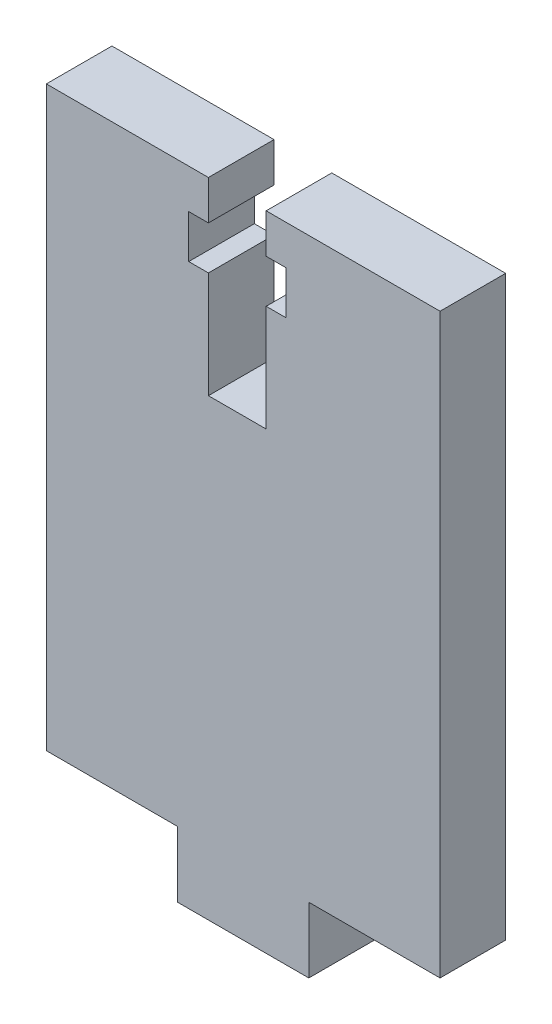
ISO-10303-21;
HEADER;
FILE_DESCRIPTION(('STEP AP214'),'2;1');
FILE_NAME('part.step','',(''),(''),'','','');
FILE_SCHEMA(('AUTOMOTIVE_DESIGN { 1 0 10303 214 1 1 1 1 }'));
ENDSEC;
DATA;
#1=APPLICATION_CONTEXT('core data for automotive mechanical design processes');
#2=APPLICATION_PROTOCOL_DEFINITION('international standard','automotive_design',2000,#1);
#3=PRODUCT_CONTEXT('',#1,'mechanical');
#4=PRODUCT('Part','Part','',(#3));
#5=PRODUCT_RELATED_PRODUCT_CATEGORY('part','',(#4));
#6=PRODUCT_DEFINITION_FORMATION('','',#4);
#7=PRODUCT_DEFINITION_CONTEXT('part definition',#1,'design');
#8=PRODUCT_DEFINITION('design','',#6,#7);
#9=PRODUCT_DEFINITION_SHAPE('','',#8);
#10=(LENGTH_UNIT() NAMED_UNIT(*) SI_UNIT(.MILLI.,.METRE.));
#11=(NAMED_UNIT(*) PLANE_ANGLE_UNIT() SI_UNIT($,.RADIAN.));
#12=(NAMED_UNIT(*) SI_UNIT($,.STERADIAN.) SOLID_ANGLE_UNIT());
#13=UNCERTAINTY_MEASURE_WITH_UNIT(LENGTH_MEASURE(1.E-05),#10,'distance_accuracy_value','');
#14=(GEOMETRIC_REPRESENTATION_CONTEXT(3) GLOBAL_UNCERTAINTY_ASSIGNED_CONTEXT((#13)) GLOBAL_UNIT_ASSIGNED_CONTEXT((#10,
#11,#12)) REPRESENTATION_CONTEXT('',''));
#15=CARTESIAN_POINT('',(0.,0.,0.));
#16=DIRECTION('',(0.,0.,1.));
#17=DIRECTION('',(1.,0.,0.));
#18=AXIS2_PLACEMENT_3D('',#15,#16,#17);
#19=CARTESIAN_POINT('',(14.7232304900181,49.,5.));
#20=DIRECTION('',(0.,-1.,0.));
#21=DIRECTION('',(0.,0.,-1.));
#22=AXIS2_PLACEMENT_3D('',#19,#20,#21);
#23=PLANE('',#22);
#24=DIRECTION('',(-1.,0.,0.));
#25=VECTOR('',#24,1.);
#26=CARTESIAN_POINT('',(14.7232304900181,49.,0.));
#27=LINE('',#26,#25);
#28=CARTESIAN_POINT('',(14.7232304900181,49.,0.));
#29=VERTEX_POINT('',#28);
#30=CARTESIAN_POINT('',(1.47285559554635,49.,0.));
#31=VERTEX_POINT('',#30);
#32=EDGE_CURVE('E159',#29,#31,#27,.T.);
#33=ORIENTED_EDGE('',*,*,#32,.T.);
#34=DIRECTION('',(0.,0.,-1.));
#35=VECTOR('',#34,1.);
#36=CARTESIAN_POINT('',(1.47285559554635,49.,5.));
#37=LINE('',#36,#35);
#38=CARTESIAN_POINT('',(1.47285559554635,49.,5.));
#39=VERTEX_POINT('',#38);
#40=EDGE_CURVE('E224',#39,#31,#37,.T.);
#41=ORIENTED_EDGE('',*,*,#40,.F.);
#42=DIRECTION('',(-1.,0.,0.));
#43=VECTOR('',#42,1.);
#44=CARTESIAN_POINT('',(14.7232304900181,49.,5.));
#45=LINE('',#44,#43);
#46=CARTESIAN_POINT('',(14.7232304900181,49.,5.));
#47=VERTEX_POINT('',#46);
#48=EDGE_CURVE('E127',#47,#39,#45,.T.);
#49=ORIENTED_EDGE('',*,*,#48,.F.);
#50=DIRECTION('',(0.,0.,-1.));
#51=VECTOR('',#50,1.);
#52=CARTESIAN_POINT('',(14.7232304900181,49.,5.));
#53=LINE('',#52,#51);
#54=EDGE_CURVE('E137',#47,#29,#53,.T.);
#55=ORIENTED_EDGE('',*,*,#54,.T.);
#56=EDGE_LOOP('',(#33,#41,#49,#55));
#57=FACE_BOUND('',#56,.T.);
#58=ADVANCED_FACE('F32',(#57),#23,.F.);
#59=CARTESIAN_POINT('',(-5.27676950998187,5.,5.));
#60=DIRECTION('',(1.,0.,0.));
#61=DIRECTION('',(0.,0.,-1.));
#62=AXIS2_PLACEMENT_3D('',#59,#60,#61);
#63=PLANE('',#62);
#64=DIRECTION('',(0.,-1.,0.));
#65=VECTOR('',#64,1.);
#66=CARTESIAN_POINT('',(-5.27676950998187,5.,0.));
#67=LINE('',#66,#65);
#68=CARTESIAN_POINT('',(-5.27676950998187,5.,0.));
#69=VERTEX_POINT('',#68);
#70=CARTESIAN_POINT('',(-5.27676950998187,0.,0.));
#71=VERTEX_POINT('',#70);
#72=EDGE_CURVE('E147',#69,#71,#67,.T.);
#73=ORIENTED_EDGE('',*,*,#72,.T.);
#74=DIRECTION('',(0.,0.,-1.));
#75=VECTOR('',#74,1.);
#76=CARTESIAN_POINT('',(-5.27676950998187,0.,5.));
#77=LINE('',#76,#75);
#78=CARTESIAN_POINT('',(-5.27676950998187,0.,5.));
#79=VERTEX_POINT('',#78);
#80=EDGE_CURVE('E11',#79,#71,#77,.T.);
#81=ORIENTED_EDGE('',*,*,#80,.F.);
#82=DIRECTION('',(0.,-1.,0.));
#83=VECTOR('',#82,1.);
#84=CARTESIAN_POINT('',(-5.27676950998187,5.,5.));
#85=LINE('',#84,#83);
#86=CARTESIAN_POINT('',(-5.27676950998187,5.,5.));
#87=VERTEX_POINT('',#86);
#88=EDGE_CURVE('E165',#87,#79,#85,.T.);
#89=ORIENTED_EDGE('',*,*,#88,.F.);
#90=DIRECTION('',(0.,0.,-1.));
#91=VECTOR('',#90,1.);
#92=CARTESIAN_POINT('',(-5.27676950998187,5.,5.));
#93=LINE('',#92,#91);
#94=EDGE_CURVE('E142',#87,#69,#93,.T.);
#95=ORIENTED_EDGE('',*,*,#94,.T.);
#96=EDGE_LOOP('',(#73,#81,#89,#95));
#97=FACE_BOUND('',#96,.T.);
#98=ADVANCED_FACE('F34',(#97),#63,.F.);
#99=CARTESIAN_POINT('',(-5.27676950998187,0.,5.));
#100=DIRECTION('',(0.,1.,0.));
#101=DIRECTION('',(0.,0.,1.));
#102=AXIS2_PLACEMENT_3D('',#99,#100,#101);
#103=PLANE('',#102);
#104=DIRECTION('',(1.,0.,0.));
#105=VECTOR('',#104,1.);
#106=CARTESIAN_POINT('',(-5.27676950998187,0.,0.));
#107=LINE('',#106,#105);
#108=CARTESIAN_POINT('',(4.72323049001813,0.,0.));
#109=VERTEX_POINT('',#108);
#110=EDGE_CURVE('E150',#71,#109,#107,.T.);
#111=ORIENTED_EDGE('',*,*,#110,.T.);
#112=DIRECTION('',(0.,0.,-1.));
#113=VECTOR('',#112,1.);
#114=CARTESIAN_POINT('',(4.72323049001813,0.,5.));
#115=LINE('',#114,#113);
#116=CARTESIAN_POINT('',(4.72323049001813,0.,5.));
#117=VERTEX_POINT('',#116);
#118=EDGE_CURVE('E40',#117,#109,#115,.T.);
#119=ORIENTED_EDGE('',*,*,#118,.F.);
#120=DIRECTION('',(1.,0.,0.));
#121=VECTOR('',#120,1.);
#122=CARTESIAN_POINT('',(-5.27676950998187,0.,5.));
#123=LINE('',#122,#121);
#124=EDGE_CURVE('E97',#79,#117,#123,.T.);
#125=ORIENTED_EDGE('',*,*,#124,.F.);
#126=ORIENTED_EDGE('',*,*,#80,.T.);
#127=EDGE_LOOP('',(#111,#119,#125,#126));
#128=FACE_BOUND('',#127,.T.);
#129=ADVANCED_FACE('F380',(#128),#103,.F.);
#130=CARTESIAN_POINT('',(4.72323049001813,0.,5.));
#131=DIRECTION('',(-1.,0.,0.));
#132=DIRECTION('',(0.,0.,1.));
#133=AXIS2_PLACEMENT_3D('',#130,#131,#132);
#134=PLANE('',#133);
#135=DIRECTION('',(0.,1.,0.));
#136=VECTOR('',#135,1.);
#137=CARTESIAN_POINT('',(4.72323049001813,0.,0.));
#138=LINE('',#137,#136);
#139=CARTESIAN_POINT('',(4.72323049001813,5.,0.));
#140=VERTEX_POINT('',#139);
#141=EDGE_CURVE('E153',#109,#140,#138,.T.);
#142=ORIENTED_EDGE('',*,*,#141,.T.);
#143=DIRECTION('',(0.,0.,-1.));
#144=VECTOR('',#143,1.);
#145=CARTESIAN_POINT('',(4.72323049001813,5.,5.));
#146=LINE('',#145,#144);
#147=CARTESIAN_POINT('',(4.72323049001813,5.,5.));
#148=VERTEX_POINT('',#147);
#149=EDGE_CURVE('E173',#148,#140,#146,.T.);
#150=ORIENTED_EDGE('',*,*,#149,.F.);
#151=DIRECTION('',(0.,1.,0.));
#152=VECTOR('',#151,1.);
#153=CARTESIAN_POINT('',(4.72323049001813,0.,5.));
#154=LINE('',#153,#152);
#155=EDGE_CURVE('E181',#117,#148,#154,.T.);
#156=ORIENTED_EDGE('',*,*,#155,.F.);
#157=ORIENTED_EDGE('',*,*,#118,.T.);
#158=EDGE_LOOP('',(#142,#150,#156,#157));
#159=FACE_BOUND('',#158,.T.);
#160=ADVANCED_FACE('F179',(#159),#134,.F.);
#161=CARTESIAN_POINT('',(4.72323049001813,5.,5.));
#162=DIRECTION('',(0.,1.,0.));
#163=DIRECTION('',(0.,0.,1.));
#164=AXIS2_PLACEMENT_3D('',#161,#162,#163);
#165=PLANE('',#164);
#166=DIRECTION('',(1.,0.,0.));
#167=VECTOR('',#166,1.);
#168=CARTESIAN_POINT('',(4.72323049001813,5.,0.));
#169=LINE('',#168,#167);
#170=CARTESIAN_POINT('',(14.7232304900181,5.,0.));
#171=VERTEX_POINT('',#170);
#172=EDGE_CURVE('E155',#140,#171,#169,.T.);
#173=ORIENTED_EDGE('',*,*,#172,.T.);
#174=DIRECTION('',(0.,0.,-1.));
#175=VECTOR('',#174,1.);
#176=CARTESIAN_POINT('',(14.7232304900181,5.,5.));
#177=LINE('',#176,#175);
#178=CARTESIAN_POINT('',(14.7232304900181,5.,5.));
#179=VERTEX_POINT('',#178);
#180=EDGE_CURVE('E170',#179,#171,#177,.T.);
#181=ORIENTED_EDGE('',*,*,#180,.F.);
#182=DIRECTION('',(1.,0.,0.));
#183=VECTOR('',#182,1.);
#184=CARTESIAN_POINT('',(4.72323049001813,5.,5.));
#185=LINE('',#184,#183);
#186=EDGE_CURVE('E198',#148,#179,#185,.T.);
#187=ORIENTED_EDGE('',*,*,#186,.F.);
#188=ORIENTED_EDGE('',*,*,#149,.T.);
#189=EDGE_LOOP('',(#173,#181,#187,#188));
#190=FACE_BOUND('',#189,.T.);
#191=ADVANCED_FACE('F191',(#190),#165,.F.);
#192=CARTESIAN_POINT('',(14.7232304900181,5.,5.));
#193=DIRECTION('',(-1.,0.,0.));
#194=DIRECTION('',(0.,0.,1.));
#195=AXIS2_PLACEMENT_3D('',#192,#193,#194);
#196=PLANE('',#195);
#197=DIRECTION('',(0.,1.,0.));
#198=VECTOR('',#197,1.);
#199=CARTESIAN_POINT('',(14.7232304900181,5.,0.));
#200=LINE('',#199,#198);
#201=EDGE_CURVE('E157',#171,#29,#200,.T.);
#202=ORIENTED_EDGE('',*,*,#201,.T.);
#203=ORIENTED_EDGE('',*,*,#54,.F.);
#204=DIRECTION('',(0.,1.,0.));
#205=VECTOR('',#204,1.);
#206=CARTESIAN_POINT('',(14.7232304900181,5.,5.));
#207=LINE('',#206,#205);
#208=EDGE_CURVE('E128',#179,#47,#207,.T.);
#209=ORIENTED_EDGE('',*,*,#208,.F.);
#210=ORIENTED_EDGE('',*,*,#180,.T.);
#211=EDGE_LOOP('',(#202,#203,#209,#210));
#212=FACE_BOUND('',#211,.T.);
#213=ADVANCED_FACE('F195',(#212),#196,.F.);
#214=CARTESIAN_POINT('',(-2.92714440445365,49.,5.));
#215=VERTEX_POINT('',#214);
#216=CARTESIAN_POINT('',(-15.2767695099819,49.,5.));
#217=VERTEX_POINT('',#216);
#218=EDGE_CURVE('E114',#215,#217,#45,.T.);
#219=ORIENTED_EDGE('',*,*,#218,.F.);
#220=DIRECTION('',(0.,0.,-1.));
#221=VECTOR('',#220,1.);
#222=CARTESIAN_POINT('',(-2.92714440445365,49.,5.));
#223=LINE('',#222,#221);
#224=CARTESIAN_POINT('',(-2.92714440445365,49.,0.));
#225=VERTEX_POINT('',#224);
#226=EDGE_CURVE('E222',#215,#225,#223,.T.);
#227=ORIENTED_EDGE('',*,*,#226,.T.);
#228=CARTESIAN_POINT('',(-15.2767695099819,49.,0.));
#229=VERTEX_POINT('',#228);
#230=EDGE_CURVE('E134',#225,#229,#27,.T.);
#231=ORIENTED_EDGE('',*,*,#230,.T.);
#232=DIRECTION('',(0.,0.,-1.));
#233=VECTOR('',#232,1.);
#234=CARTESIAN_POINT('',(-15.2767695099819,49.,5.));
#235=LINE('',#234,#233);
#236=EDGE_CURVE('E131',#217,#229,#235,.T.);
#237=ORIENTED_EDGE('',*,*,#236,.F.);
#238=EDGE_LOOP('',(#219,#227,#231,#237));
#239=FACE_BOUND('',#238,.T.);
#240=ADVANCED_FACE('F132',(#239),#23,.F.);
#241=CARTESIAN_POINT('',(-15.2767695099819,49.,5.));
#242=DIRECTION('',(1.,0.,0.));
#243=DIRECTION('',(0.,1.,0.));
#244=AXIS2_PLACEMENT_3D('',#241,#242,#243);
#245=PLANE('',#244);
#246=DIRECTION('',(0.,-1.,0.));
#247=VECTOR('',#246,1.);
#248=CARTESIAN_POINT('',(-15.2767695099819,49.,0.));
#249=LINE('',#248,#247);
#250=CARTESIAN_POINT('',(-15.2767695099819,5.,0.));
#251=VERTEX_POINT('',#250);
#252=EDGE_CURVE('E162',#229,#251,#249,.T.);
#253=ORIENTED_EDGE('',*,*,#252,.T.);
#254=DIRECTION('',(0.,0.,-1.));
#255=VECTOR('',#254,1.);
#256=CARTESIAN_POINT('',(-15.2767695099819,5.,5.));
#257=LINE('',#256,#255);
#258=CARTESIAN_POINT('',(-15.2767695099819,5.,5.));
#259=VERTEX_POINT('',#258);
#260=EDGE_CURVE('E138',#259,#251,#257,.T.);
#261=ORIENTED_EDGE('',*,*,#260,.F.);
#262=DIRECTION('',(0.,-1.,0.));
#263=VECTOR('',#262,1.);
#264=CARTESIAN_POINT('',(-15.2767695099819,49.,5.));
#265=LINE('',#264,#263);
#266=EDGE_CURVE('E119',#217,#259,#265,.T.);
#267=ORIENTED_EDGE('',*,*,#266,.F.);
#268=ORIENTED_EDGE('',*,*,#236,.T.);
#269=EDGE_LOOP('',(#253,#261,#267,#268));
#270=FACE_BOUND('',#269,.T.);
#271=ADVANCED_FACE('F140',(#270),#245,.F.);
#272=CARTESIAN_POINT('',(-15.2767695099819,5.,5.));
#273=DIRECTION('',(0.,1.,0.));
#274=DIRECTION('',(0.,0.,1.));
#275=AXIS2_PLACEMENT_3D('',#272,#273,#274);
#276=PLANE('',#275);
#277=DIRECTION('',(1.,0.,0.));
#278=VECTOR('',#277,1.);
#279=CARTESIAN_POINT('',(-15.2767695099819,5.,0.));
#280=LINE('',#279,#278);
#281=EDGE_CURVE('E89',#251,#69,#280,.T.);
#282=ORIENTED_EDGE('',*,*,#281,.T.);
#283=ORIENTED_EDGE('',*,*,#94,.F.);
#284=DIRECTION('',(1.,0.,0.));
#285=VECTOR('',#284,1.);
#286=CARTESIAN_POINT('',(-15.2767695099819,5.,5.));
#287=LINE('',#286,#285);
#288=EDGE_CURVE('E56',#259,#87,#287,.T.);
#289=ORIENTED_EDGE('',*,*,#288,.F.);
#290=ORIENTED_EDGE('',*,*,#260,.T.);
#291=EDGE_LOOP('',(#282,#283,#289,#290));
#292=FACE_BOUND('',#291,.T.);
#293=ADVANCED_FACE('F389',(#292),#276,.F.);
#294=CARTESIAN_POINT('',(0.,0.,5.));
#295=DIRECTION('',(0.,0.,1.));
#296=DIRECTION('',(1.,0.,0.));
#297=AXIS2_PLACEMENT_3D('',#294,#295,#296);
#298=PLANE('',#297);
#299=DIRECTION('',(0.,-1.,0.));
#300=VECTOR('',#299,1.);
#301=CARTESIAN_POINT('',(1.47285559554635,46.,5.));
#302=LINE('',#301,#300);
#303=CARTESIAN_POINT('',(1.47285559554635,46.,5.));
#304=VERTEX_POINT('',#303);
#305=EDGE_CURVE('E277',#39,#304,#302,.T.);
#306=ORIENTED_EDGE('',*,*,#305,.T.);
#307=DIRECTION('',(1.,0.,0.));
#308=VECTOR('',#307,1.);
#309=CARTESIAN_POINT('',(2.97285559554635,46.,5.));
#310=LINE('',#309,#308);
#311=CARTESIAN_POINT('',(2.97285559554635,46.,5.));
#312=VERTEX_POINT('',#311);
#313=EDGE_CURVE('E274',#304,#312,#310,.T.);
#314=ORIENTED_EDGE('',*,*,#313,.T.);
#315=DIRECTION('',(0.,-1.,0.));
#316=VECTOR('',#315,1.);
#317=CARTESIAN_POINT('',(2.97285559554637,42.7,5.));
#318=LINE('',#317,#316);
#319=CARTESIAN_POINT('',(2.97285559554637,42.7,5.));
#320=VERTEX_POINT('',#319);
#321=EDGE_CURVE('E271',#312,#320,#318,.T.);
#322=ORIENTED_EDGE('',*,*,#321,.T.);
#323=DIRECTION('',(-1.,0.,0.));
#324=VECTOR('',#323,1.);
#325=CARTESIAN_POINT('',(1.47285559554635,42.7,5.));
#326=LINE('',#325,#324);
#327=CARTESIAN_POINT('',(1.47285559554635,42.7,5.));
#328=VERTEX_POINT('',#327);
#329=EDGE_CURVE('E207',#320,#328,#326,.T.);
#330=ORIENTED_EDGE('',*,*,#329,.T.);
#331=DIRECTION('',(0.,-1.,0.));
#332=VECTOR('',#331,1.);
#333=CARTESIAN_POINT('',(1.47285559554633,34.6,5.));
#334=LINE('',#333,#332);
#335=CARTESIAN_POINT('',(1.47285559554633,34.6,5.));
#336=VERTEX_POINT('',#335);
#337=EDGE_CURVE('E240',#328,#336,#334,.T.);
#338=ORIENTED_EDGE('',*,*,#337,.T.);
#339=DIRECTION('',(-1.,0.,0.));
#340=VECTOR('',#339,1.);
#341=CARTESIAN_POINT('',(1.47285559554633,34.6,5.));
#342=LINE('',#341,#340);
#343=CARTESIAN_POINT('',(-2.92714440445368,34.6,5.));
#344=VERTEX_POINT('',#343);
#345=EDGE_CURVE('E291',#336,#344,#342,.T.);
#346=ORIENTED_EDGE('',*,*,#345,.T.);
#347=DIRECTION('',(0.,1.,0.));
#348=VECTOR('',#347,1.);
#349=CARTESIAN_POINT('',(-2.92714440445365,42.7,5.));
#350=LINE('',#349,#348);
#351=CARTESIAN_POINT('',(-2.92714440445365,42.7,5.));
#352=VERTEX_POINT('',#351);
#353=EDGE_CURVE('E288',#344,#352,#350,.T.);
#354=ORIENTED_EDGE('',*,*,#353,.T.);
#355=DIRECTION('',(-1.,0.,0.));
#356=VECTOR('',#355,1.);
#357=CARTESIAN_POINT('',(-4.42714440445366,42.7,5.));
#358=LINE('',#357,#356);
#359=CARTESIAN_POINT('',(-4.42714440445366,42.7,5.));
#360=VERTEX_POINT('',#359);
#361=EDGE_CURVE('E285',#352,#360,#358,.T.);
#362=ORIENTED_EDGE('',*,*,#361,.T.);
#363=DIRECTION('',(0.,1.,0.));
#364=VECTOR('',#363,1.);
#365=CARTESIAN_POINT('',(-4.42714440445366,46.,5.));
#366=LINE('',#365,#364);
#367=CARTESIAN_POINT('',(-4.42714440445366,46.,5.));
#368=VERTEX_POINT('',#367);
#369=EDGE_CURVE('E282',#360,#368,#366,.T.);
#370=ORIENTED_EDGE('',*,*,#369,.T.);
#371=DIRECTION('',(1.,0.,0.));
#372=VECTOR('',#371,1.);
#373=CARTESIAN_POINT('',(-2.92714440445365,46.,5.));
#374=LINE('',#373,#372);
#375=CARTESIAN_POINT('',(-2.92714440445365,46.,5.));
#376=VERTEX_POINT('',#375);
#377=EDGE_CURVE('E280',#368,#376,#374,.T.);
#378=ORIENTED_EDGE('',*,*,#377,.T.);
#379=DIRECTION('',(0.,1.,0.));
#380=VECTOR('',#379,1.);
#381=CARTESIAN_POINT('',(-2.92714440445365,49.,5.));
#382=LINE('',#381,#380);
#383=EDGE_CURVE('E124',#376,#215,#382,.T.);
#384=ORIENTED_EDGE('',*,*,#383,.T.);
#385=ORIENTED_EDGE('',*,*,#218,.T.);
#386=ORIENTED_EDGE('',*,*,#266,.T.);
#387=ORIENTED_EDGE('',*,*,#288,.T.);
#388=ORIENTED_EDGE('',*,*,#88,.T.);
#389=ORIENTED_EDGE('',*,*,#124,.T.);
#390=ORIENTED_EDGE('',*,*,#155,.T.);
#391=ORIENTED_EDGE('',*,*,#186,.T.);
#392=ORIENTED_EDGE('',*,*,#208,.T.);
#393=ORIENTED_EDGE('',*,*,#48,.T.);
#394=EDGE_LOOP('',(#306,#314,#322,#330,#338,#346,#354,#362,#370,#378,#384,#385,#386,#387,#388,
#389,#390,#391,#392,#393));
#395=FACE_BOUND('',#394,.T.);
#396=ADVANCED_FACE('F117',(#395),#298,.T.);
#397=CARTESIAN_POINT('',(0.,0.,0.));
#398=DIRECTION('',(0.,0.,1.));
#399=DIRECTION('',(1.,0.,0.));
#400=AXIS2_PLACEMENT_3D('',#397,#398,#399);
#401=PLANE('',#400);
#402=DIRECTION('',(1.,0.,0.));
#403=VECTOR('',#402,1.);
#404=CARTESIAN_POINT('',(2.97285559554635,46.,0.));
#405=LINE('',#404,#403);
#406=CARTESIAN_POINT('',(1.47285559554635,46.,0.));
#407=VERTEX_POINT('',#406);
#408=CARTESIAN_POINT('',(2.97285559554635,46.,0.));
#409=VERTEX_POINT('',#408);
#410=EDGE_CURVE('E244',#407,#409,#405,.T.);
#411=ORIENTED_EDGE('',*,*,#410,.F.);
#412=DIRECTION('',(0.,-1.,0.));
#413=VECTOR('',#412,1.);
#414=CARTESIAN_POINT('',(1.47285559554635,46.,0.));
#415=LINE('',#414,#413);
#416=EDGE_CURVE('E247',#31,#407,#415,.T.);
#417=ORIENTED_EDGE('',*,*,#416,.F.);
#418=ORIENTED_EDGE('',*,*,#32,.F.);
#419=ORIENTED_EDGE('',*,*,#201,.F.);
#420=ORIENTED_EDGE('',*,*,#172,.F.);
#421=ORIENTED_EDGE('',*,*,#141,.F.);
#422=ORIENTED_EDGE('',*,*,#110,.F.);
#423=ORIENTED_EDGE('',*,*,#72,.F.);
#424=ORIENTED_EDGE('',*,*,#281,.F.);
#425=ORIENTED_EDGE('',*,*,#252,.F.);
#426=ORIENTED_EDGE('',*,*,#230,.F.);
#427=DIRECTION('',(0.,1.,0.));
#428=VECTOR('',#427,1.);
#429=CARTESIAN_POINT('',(-2.92714440445365,49.,0.));
#430=LINE('',#429,#428);
#431=CARTESIAN_POINT('',(-2.92714440445365,46.,0.));
#432=VERTEX_POINT('',#431);
#433=EDGE_CURVE('E250',#432,#225,#430,.T.);
#434=ORIENTED_EDGE('',*,*,#433,.F.);
#435=DIRECTION('',(1.,0.,0.));
#436=VECTOR('',#435,1.);
#437=CARTESIAN_POINT('',(-2.92714440445365,46.,0.));
#438=LINE('',#437,#436);
#439=CARTESIAN_POINT('',(-4.42714440445366,46.,0.));
#440=VERTEX_POINT('',#439);
#441=EDGE_CURVE('E253',#440,#432,#438,.T.);
#442=ORIENTED_EDGE('',*,*,#441,.F.);
#443=DIRECTION('',(0.,1.,0.));
#444=VECTOR('',#443,1.);
#445=CARTESIAN_POINT('',(-4.42714440445366,46.,0.));
#446=LINE('',#445,#444);
#447=CARTESIAN_POINT('',(-4.42714440445366,42.7,0.));
#448=VERTEX_POINT('',#447);
#449=EDGE_CURVE('E256',#448,#440,#446,.T.);
#450=ORIENTED_EDGE('',*,*,#449,.F.);
#451=DIRECTION('',(-1.,0.,0.));
#452=VECTOR('',#451,1.);
#453=CARTESIAN_POINT('',(-4.42714440445366,42.7,0.));
#454=LINE('',#453,#452);
#455=CARTESIAN_POINT('',(-2.92714440445365,42.7,0.));
#456=VERTEX_POINT('',#455);
#457=EDGE_CURVE('E259',#456,#448,#454,.T.);
#458=ORIENTED_EDGE('',*,*,#457,.F.);
#459=DIRECTION('',(0.,1.,0.));
#460=VECTOR('',#459,1.);
#461=CARTESIAN_POINT('',(-2.92714440445365,42.7,0.));
#462=LINE('',#461,#460);
#463=CARTESIAN_POINT('',(-2.92714440445368,34.6,0.));
#464=VERTEX_POINT('',#463);
#465=EDGE_CURVE('E262',#464,#456,#462,.T.);
#466=ORIENTED_EDGE('',*,*,#465,.F.);
#467=DIRECTION('',(-1.,0.,0.));
#468=VECTOR('',#467,1.);
#469=CARTESIAN_POINT('',(1.47285559554633,34.6,0.));
#470=LINE('',#469,#468);
#471=CARTESIAN_POINT('',(1.47285559554633,34.6,0.));
#472=VERTEX_POINT('',#471);
#473=EDGE_CURVE('E265',#472,#464,#470,.T.);
#474=ORIENTED_EDGE('',*,*,#473,.F.);
#475=DIRECTION('',(0.,-1.,0.));
#476=VECTOR('',#475,1.);
#477=CARTESIAN_POINT('',(1.47285559554633,34.6,0.));
#478=LINE('',#477,#476);
#479=CARTESIAN_POINT('',(1.47285559554635,42.7,0.));
#480=VERTEX_POINT('',#479);
#481=EDGE_CURVE('E47',#480,#472,#478,.T.);
#482=ORIENTED_EDGE('',*,*,#481,.F.);
#483=DIRECTION('',(-1.,0.,0.));
#484=VECTOR('',#483,1.);
#485=CARTESIAN_POINT('',(1.47285559554635,42.7,0.));
#486=LINE('',#485,#484);
#487=CARTESIAN_POINT('',(2.97285559554637,42.7,0.));
#488=VERTEX_POINT('',#487);
#489=EDGE_CURVE('E237',#488,#480,#486,.T.);
#490=ORIENTED_EDGE('',*,*,#489,.F.);
#491=DIRECTION('',(0.,-1.,0.));
#492=VECTOR('',#491,1.);
#493=CARTESIAN_POINT('',(2.97285559554637,42.7,0.));
#494=LINE('',#493,#492);
#495=EDGE_CURVE('E241',#409,#488,#494,.T.);
#496=ORIENTED_EDGE('',*,*,#495,.F.);
#497=EDGE_LOOP('',(#411,#417,#418,#419,#420,#421,#422,#423,#424,#425,#426,#434,#442,#450,#458,
#466,#474,#482,#490,#496));
#498=FACE_BOUND('',#497,.T.);
#499=ADVANCED_FACE('F185',(#498),#401,.F.);
#500=CARTESIAN_POINT('',(1.47285559554633,34.6,5.));
#501=DIRECTION('',(1.,0.,0.));
#502=DIRECTION('',(0.,1.,0.));
#503=AXIS2_PLACEMENT_3D('',#500,#501,#502);
#504=PLANE('',#503);
#505=ORIENTED_EDGE('',*,*,#481,.T.);
#506=DIRECTION('',(0.,0.,-1.));
#507=VECTOR('',#506,1.);
#508=CARTESIAN_POINT('',(1.47285559554633,34.6,5.));
#509=LINE('',#508,#507);
#510=EDGE_CURVE('E204',#336,#472,#509,.T.);
#511=ORIENTED_EDGE('',*,*,#510,.F.);
#512=ORIENTED_EDGE('',*,*,#337,.F.);
#513=DIRECTION('',(0.,0.,-1.));
#514=VECTOR('',#513,1.);
#515=CARTESIAN_POINT('',(1.47285559554635,42.7,5.));
#516=LINE('',#515,#514);
#517=EDGE_CURVE('E151',#328,#480,#516,.T.);
#518=ORIENTED_EDGE('',*,*,#517,.T.);
#519=EDGE_LOOP('',(#505,#511,#512,#518));
#520=FACE_BOUND('',#519,.T.);
#521=ADVANCED_FACE('F301',(#520),#504,.F.);
#522=CARTESIAN_POINT('',(1.47285559554635,42.7,5.));
#523=DIRECTION('',(0.,-1.,0.));
#524=DIRECTION('',(0.,0.,-1.));
#525=AXIS2_PLACEMENT_3D('',#522,#523,#524);
#526=PLANE('',#525);
#527=ORIENTED_EDGE('',*,*,#489,.T.);
#528=ORIENTED_EDGE('',*,*,#517,.F.);
#529=ORIENTED_EDGE('',*,*,#329,.F.);
#530=DIRECTION('',(0.,0.,-1.));
#531=VECTOR('',#530,1.);
#532=CARTESIAN_POINT('',(2.97285559554637,42.7,5.));
#533=LINE('',#532,#531);
#534=EDGE_CURVE('E233',#320,#488,#533,.T.);
#535=ORIENTED_EDGE('',*,*,#534,.T.);
#536=EDGE_LOOP('',(#527,#528,#529,#535));
#537=FACE_BOUND('',#536,.T.);
#538=ADVANCED_FACE('F329',(#537),#526,.F.);
#539=CARTESIAN_POINT('',(2.97285559554637,42.7,5.));
#540=DIRECTION('',(1.,0.,0.));
#541=DIRECTION('',(0.,1.,0.));
#542=AXIS2_PLACEMENT_3D('',#539,#540,#541);
#543=PLANE('',#542);
#544=ORIENTED_EDGE('',*,*,#495,.T.);
#545=ORIENTED_EDGE('',*,*,#534,.F.);
#546=ORIENTED_EDGE('',*,*,#321,.F.);
#547=DIRECTION('',(0.,0.,-1.));
#548=VECTOR('',#547,1.);
#549=CARTESIAN_POINT('',(2.97285559554635,46.,5.));
#550=LINE('',#549,#548);
#551=EDGE_CURVE('E230',#312,#409,#550,.T.);
#552=ORIENTED_EDGE('',*,*,#551,.T.);
#553=EDGE_LOOP('',(#544,#545,#546,#552));
#554=FACE_BOUND('',#553,.T.);
#555=ADVANCED_FACE('F334',(#554),#543,.F.);
#556=CARTESIAN_POINT('',(2.97285559554635,46.,5.));
#557=DIRECTION('',(0.,1.,0.));
#558=DIRECTION('',(0.,0.,1.));
#559=AXIS2_PLACEMENT_3D('',#556,#557,#558);
#560=PLANE('',#559);
#561=ORIENTED_EDGE('',*,*,#410,.T.);
#562=ORIENTED_EDGE('',*,*,#551,.F.);
#563=ORIENTED_EDGE('',*,*,#313,.F.);
#564=DIRECTION('',(0.,0.,-1.));
#565=VECTOR('',#564,1.);
#566=CARTESIAN_POINT('',(1.47285559554635,46.,5.));
#567=LINE('',#566,#565);
#568=EDGE_CURVE('E227',#304,#407,#567,.T.);
#569=ORIENTED_EDGE('',*,*,#568,.T.);
#570=EDGE_LOOP('',(#561,#562,#563,#569));
#571=FACE_BOUND('',#570,.T.);
#572=ADVANCED_FACE('F369',(#571),#560,.F.);
#573=CARTESIAN_POINT('',(1.47285559554635,46.,5.));
#574=DIRECTION('',(1.,0.,0.));
#575=DIRECTION('',(0.,0.,-1.));
#576=AXIS2_PLACEMENT_3D('',#573,#574,#575);
#577=PLANE('',#576);
#578=ORIENTED_EDGE('',*,*,#416,.T.);
#579=ORIENTED_EDGE('',*,*,#568,.F.);
#580=ORIENTED_EDGE('',*,*,#305,.F.);
#581=ORIENTED_EDGE('',*,*,#40,.T.);
#582=EDGE_LOOP('',(#578,#579,#580,#581));
#583=FACE_BOUND('',#582,.T.);
#584=ADVANCED_FACE('F372',(#583),#577,.F.);
#585=CARTESIAN_POINT('',(-2.92714440445365,49.,5.));
#586=DIRECTION('',(-1.,0.,0.));
#587=DIRECTION('',(0.,-1.,0.));
#588=AXIS2_PLACEMENT_3D('',#585,#586,#587);
#589=PLANE('',#588);
#590=ORIENTED_EDGE('',*,*,#433,.T.);
#591=ORIENTED_EDGE('',*,*,#226,.F.);
#592=ORIENTED_EDGE('',*,*,#383,.F.);
#593=DIRECTION('',(0.,0.,-1.));
#594=VECTOR('',#593,1.);
#595=CARTESIAN_POINT('',(-2.92714440445365,46.,5.));
#596=LINE('',#595,#594);
#597=EDGE_CURVE('E219',#376,#432,#596,.T.);
#598=ORIENTED_EDGE('',*,*,#597,.T.);
#599=EDGE_LOOP('',(#590,#591,#592,#598));
#600=FACE_BOUND('',#599,.T.);
#601=ADVANCED_FACE('F428',(#600),#589,.F.);
#602=CARTESIAN_POINT('',(-2.92714440445365,46.,5.));
#603=DIRECTION('',(0.,1.,0.));
#604=DIRECTION('',(0.,0.,1.));
#605=AXIS2_PLACEMENT_3D('',#602,#603,#604);
#606=PLANE('',#605);
#607=ORIENTED_EDGE('',*,*,#441,.T.);
#608=ORIENTED_EDGE('',*,*,#597,.F.);
#609=ORIENTED_EDGE('',*,*,#377,.F.);
#610=DIRECTION('',(0.,0.,-1.));
#611=VECTOR('',#610,1.);
#612=CARTESIAN_POINT('',(-4.42714440445366,46.,5.));
#613=LINE('',#612,#611);
#614=EDGE_CURVE('E216',#368,#440,#613,.T.);
#615=ORIENTED_EDGE('',*,*,#614,.T.);
#616=EDGE_LOOP('',(#607,#608,#609,#615));
#617=FACE_BOUND('',#616,.T.);
#618=ADVANCED_FACE('F424',(#617),#606,.F.);
#619=CARTESIAN_POINT('',(-4.42714440445366,46.,5.));
#620=DIRECTION('',(-1.,0.,0.));
#621=DIRECTION('',(0.,0.,1.));
#622=AXIS2_PLACEMENT_3D('',#619,#620,#621);
#623=PLANE('',#622);
#624=ORIENTED_EDGE('',*,*,#449,.T.);
#625=ORIENTED_EDGE('',*,*,#614,.F.);
#626=ORIENTED_EDGE('',*,*,#369,.F.);
#627=DIRECTION('',(0.,0.,-1.));
#628=VECTOR('',#627,1.);
#629=CARTESIAN_POINT('',(-4.42714440445366,42.7,5.));
#630=LINE('',#629,#628);
#631=EDGE_CURVE('E213',#360,#448,#630,.T.);
#632=ORIENTED_EDGE('',*,*,#631,.T.);
#633=EDGE_LOOP('',(#624,#625,#626,#632));
#634=FACE_BOUND('',#633,.T.);
#635=ADVANCED_FACE('F420',(#634),#623,.F.);
#636=CARTESIAN_POINT('',(-4.42714440445366,42.7,5.));
#637=DIRECTION('',(0.,-1.,0.));
#638=DIRECTION('',(0.,0.,-1.));
#639=AXIS2_PLACEMENT_3D('',#636,#637,#638);
#640=PLANE('',#639);
#641=ORIENTED_EDGE('',*,*,#457,.T.);
#642=ORIENTED_EDGE('',*,*,#631,.F.);
#643=ORIENTED_EDGE('',*,*,#361,.F.);
#644=DIRECTION('',(0.,0.,-1.));
#645=VECTOR('',#644,1.);
#646=CARTESIAN_POINT('',(-2.92714440445365,42.7,5.));
#647=LINE('',#646,#645);
#648=EDGE_CURVE('E210',#352,#456,#647,.T.);
#649=ORIENTED_EDGE('',*,*,#648,.T.);
#650=EDGE_LOOP('',(#641,#642,#643,#649));
#651=FACE_BOUND('',#650,.T.);
#652=ADVANCED_FACE('F417',(#651),#640,.F.);
#653=CARTESIAN_POINT('',(-2.92714440445365,42.7,5.));
#654=DIRECTION('',(-1.,0.,0.));
#655=DIRECTION('',(0.,-1.,0.));
#656=AXIS2_PLACEMENT_3D('',#653,#654,#655);
#657=PLANE('',#656);
#658=ORIENTED_EDGE('',*,*,#465,.T.);
#659=ORIENTED_EDGE('',*,*,#648,.F.);
#660=ORIENTED_EDGE('',*,*,#353,.F.);
#661=DIRECTION('',(0.,0.,-1.));
#662=VECTOR('',#661,1.);
#663=CARTESIAN_POINT('',(-2.92714440445368,34.6,5.));
#664=LINE('',#663,#662);
#665=EDGE_CURVE('E206',#344,#464,#664,.T.);
#666=ORIENTED_EDGE('',*,*,#665,.T.);
#667=EDGE_LOOP('',(#658,#659,#660,#666));
#668=FACE_BOUND('',#667,.T.);
#669=ADVANCED_FACE('F347',(#668),#657,.F.);
#670=CARTESIAN_POINT('',(1.47285559554633,34.6,5.));
#671=DIRECTION('',(0.,-1.,0.));
#672=DIRECTION('',(0.,0.,-1.));
#673=AXIS2_PLACEMENT_3D('',#670,#671,#672);
#674=PLANE('',#673);
#675=ORIENTED_EDGE('',*,*,#473,.T.);
#676=ORIENTED_EDGE('',*,*,#665,.F.);
#677=ORIENTED_EDGE('',*,*,#345,.F.);
#678=ORIENTED_EDGE('',*,*,#510,.T.);
#679=EDGE_LOOP('',(#675,#676,#677,#678));
#680=FACE_BOUND('',#679,.T.);
#681=ADVANCED_FACE('F341',(#680),#674,.F.);
#682=CLOSED_SHELL('',(#58,#98,#129,#160,#191,#213,#240,#271,#293,#396,#499,#521,#538,#555,#572,
#584,#601,#618,#635,#652,#669,#681));
#683=MANIFOLD_SOLID_BREP('B2',#682);
#684=ADVANCED_BREP_SHAPE_REPRESENTATION('',(#18,#683),#14);
#685=SHAPE_DEFINITION_REPRESENTATION(#9,#684);
ENDSEC;
END-ISO-10303-21;
